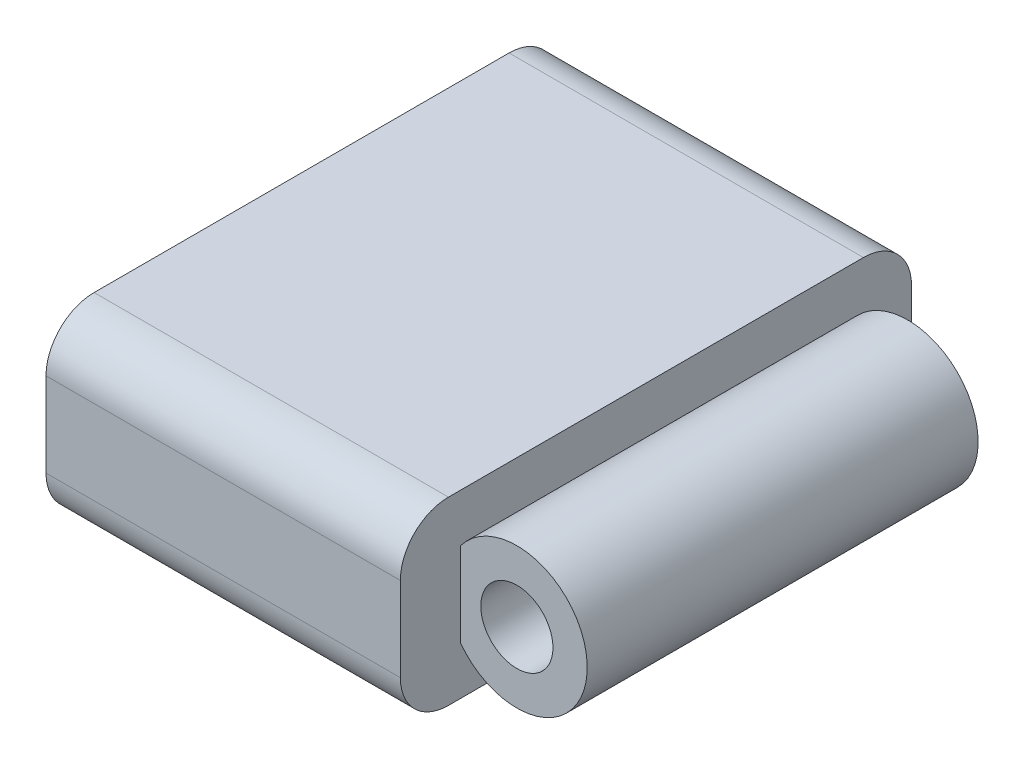
ISO-10303-21;
HEADER;
FILE_DESCRIPTION(('STEP AP214'),'2;1');
FILE_NAME('part.step','',(''),(''),'','','');
FILE_SCHEMA(('AUTOMOTIVE_DESIGN { 1 0 10303 214 1 1 1 1 }'));
ENDSEC;
DATA;
#1=APPLICATION_CONTEXT('core data for automotive mechanical design processes');
#2=APPLICATION_PROTOCOL_DEFINITION('international standard','automotive_design',2000,#1);
#3=PRODUCT_CONTEXT('',#1,'mechanical');
#4=PRODUCT('Part','Part','',(#3));
#5=PRODUCT_RELATED_PRODUCT_CATEGORY('part','',(#4));
#6=PRODUCT_DEFINITION_FORMATION('','',#4);
#7=PRODUCT_DEFINITION_CONTEXT('part definition',#1,'design');
#8=PRODUCT_DEFINITION('design','',#6,#7);
#9=PRODUCT_DEFINITION_SHAPE('','',#8);
#10=(LENGTH_UNIT() NAMED_UNIT(*) SI_UNIT(.MILLI.,.METRE.));
#11=(NAMED_UNIT(*) PLANE_ANGLE_UNIT() SI_UNIT($,.RADIAN.));
#12=(NAMED_UNIT(*) SI_UNIT($,.STERADIAN.) SOLID_ANGLE_UNIT());
#13=UNCERTAINTY_MEASURE_WITH_UNIT(LENGTH_MEASURE(1.E-05),#10,'distance_accuracy_value','');
#14=(GEOMETRIC_REPRESENTATION_CONTEXT(3) GLOBAL_UNCERTAINTY_ASSIGNED_CONTEXT((#13)) GLOBAL_UNIT_ASSIGNED_CONTEXT((#10,
#11,#12)) REPRESENTATION_CONTEXT('',''));
#15=CARTESIAN_POINT('',(0.,0.,0.));
#16=DIRECTION('',(0.,0.,1.));
#17=DIRECTION('',(1.,0.,0.));
#18=AXIS2_PLACEMENT_3D('',#15,#16,#17);
#19=CARTESIAN_POINT('',(0.,19.05,0.));
#20=DIRECTION('',(0.,0.,-1.));
#21=DIRECTION('',(-1.,0.,0.));
#22=AXIS2_PLACEMENT_3D('',#19,#20,#21);
#23=PLANE('',#22);
#24=DIRECTION('',(1.,0.,0.));
#25=VECTOR('',#24,1.);
#26=CARTESIAN_POINT('',(50.8,5.08,0.));
#27=LINE('',#26,#25);
#28=CARTESIAN_POINT('',(0.,5.08,0.));
#29=VERTEX_POINT('',#28);
#30=CARTESIAN_POINT('',(37.4173961667043,5.08,0.));
#31=VERTEX_POINT('',#30);
#32=EDGE_CURVE('E226',#29,#31,#27,.T.);
#33=ORIENTED_EDGE('',*,*,#32,.T.);
#34=DIRECTION('',(0.,1.,0.));
#35=VECTOR('',#34,1.);
#36=CARTESIAN_POINT('',(37.4173961667043,0.,0.));
#37=LINE('',#36,#35);
#38=CARTESIAN_POINT('',(37.4173961667043,13.97,0.));
#39=VERTEX_POINT('',#38);
#40=EDGE_CURVE('E318',#31,#39,#37,.T.);
#41=ORIENTED_EDGE('',*,*,#40,.T.);
#42=DIRECTION('',(1.,0.,0.));
#43=VECTOR('',#42,1.);
#44=CARTESIAN_POINT('',(0.,13.97,0.));
#45=LINE('',#44,#43);
#46=CARTESIAN_POINT('',(0.,13.97,0.));
#47=VERTEX_POINT('',#46);
#48=EDGE_CURVE('E224',#39,#47,#45,.F.);
#49=ORIENTED_EDGE('',*,*,#48,.T.);
#50=DIRECTION('',(0.,-1.,0.));
#51=VECTOR('',#50,1.);
#52=CARTESIAN_POINT('',(0.,19.05,0.));
#53=LINE('',#52,#51);
#54=EDGE_CURVE('E203',#47,#29,#53,.T.);
#55=ORIENTED_EDGE('',*,*,#54,.T.);
#56=EDGE_LOOP('',(#33,#41,#49,#55));
#57=FACE_BOUND('',#56,.T.);
#58=ADVANCED_FACE('F36',(#57),#23,.F.);
#59=CARTESIAN_POINT('',(0.,19.05,-53.975));
#60=DIRECTION('',(0.,0.,1.));
#61=DIRECTION('',(1.,0.,0.));
#62=AXIS2_PLACEMENT_3D('',#59,#60,#61);
#63=PLANE('',#62);
#64=DIRECTION('',(-1.,0.,0.));
#65=VECTOR('',#64,1.);
#66=CARTESIAN_POINT('',(0.,13.97,-53.975));
#67=LINE('',#66,#65);
#68=CARTESIAN_POINT('',(0.,13.97,-53.975));
#69=VERTEX_POINT('',#68);
#70=CARTESIAN_POINT('',(37.4173961667043,13.97,-53.975));
#71=VERTEX_POINT('',#70);
#72=EDGE_CURVE('E206',#69,#71,#67,.F.);
#73=ORIENTED_EDGE('',*,*,#72,.T.);
#74=DIRECTION('',(0.,1.,0.));
#75=VECTOR('',#74,1.);
#76=CARTESIAN_POINT('',(37.4173961667043,0.,-53.975));
#77=LINE('',#76,#75);
#78=CARTESIAN_POINT('',(37.4173961667043,5.08,-53.975));
#79=VERTEX_POINT('',#78);
#80=EDGE_CURVE('E176',#79,#71,#77,.T.);
#81=ORIENTED_EDGE('',*,*,#80,.F.);
#82=DIRECTION('',(-1.,0.,0.));
#83=VECTOR('',#82,1.);
#84=CARTESIAN_POINT('',(0.,5.08,-53.975));
#85=LINE('',#84,#83);
#86=CARTESIAN_POINT('',(0.,5.08,-53.975));
#87=VERTEX_POINT('',#86);
#88=EDGE_CURVE('E209',#79,#87,#85,.T.);
#89=ORIENTED_EDGE('',*,*,#88,.T.);
#90=DIRECTION('',(0.,-1.,0.));
#91=VECTOR('',#90,1.);
#92=CARTESIAN_POINT('',(0.,19.05,-53.975));
#93=LINE('',#92,#91);
#94=EDGE_CURVE('E198',#69,#87,#93,.T.);
#95=ORIENTED_EDGE('',*,*,#94,.F.);
#96=EDGE_LOOP('',(#73,#81,#89,#95));
#97=FACE_BOUND('',#96,.T.);
#98=ADVANCED_FACE('F332',(#97),#63,.F.);
#99=CARTESIAN_POINT('',(0.,19.05,0.));
#100=DIRECTION('',(1.,0.,0.));
#101=DIRECTION('',(0.,0.,-1.));
#102=AXIS2_PLACEMENT_3D('',#99,#100,#101);
#103=PLANE('',#102);
#104=DIRECTION('',(0.,0.,1.));
#105=VECTOR('',#104,1.);
#106=CARTESIAN_POINT('',(0.,1.90500000000001,-6.66749999999999));
#107=LINE('',#106,#105);
#108=CARTESIAN_POINT('',(0.,1.905,-44.7675));
#109=VERTEX_POINT('',#108);
#110=CARTESIAN_POINT('',(0.,1.90500000000001,-9.20749999999999));
#111=VERTEX_POINT('',#110);
#112=EDGE_CURVE('E274',#109,#111,#107,.T.);
#113=ORIENTED_EDGE('',*,*,#112,.F.);
#114=CARTESIAN_POINT('',(0.,4.44500000000001,-44.7675));
#115=DIRECTION('',(1.,0.,0.));
#116=DIRECTION('',(0.,0.,-1.));
#117=AXIS2_PLACEMENT_3D('',#114,#115,#116);
#118=CIRCLE('',#117,2.54);
#119=CARTESIAN_POINT('',(0.,4.44500000000001,-47.3075));
#120=VERTEX_POINT('',#119);
#121=EDGE_CURVE('E44',#109,#120,#118,.T.);
#122=ORIENTED_EDGE('',*,*,#121,.T.);
#123=DIRECTION('',(0.,-1.,0.));
#124=VECTOR('',#123,1.);
#125=CARTESIAN_POINT('',(0.,1.905,-47.3075));
#126=LINE('',#125,#124);
#127=CARTESIAN_POINT('',(0.,14.605,-47.3075));
#128=VERTEX_POINT('',#127);
#129=EDGE_CURVE('E285',#128,#120,#126,.T.);
#130=ORIENTED_EDGE('',*,*,#129,.F.);
#131=CARTESIAN_POINT('',(0.,14.605,-44.7675));
#132=DIRECTION('',(1.,0.,0.));
#133=DIRECTION('',(0.,0.,-1.));
#134=AXIS2_PLACEMENT_3D('',#131,#132,#133);
#135=CIRCLE('',#134,2.54);
#136=CARTESIAN_POINT('',(0.,17.145,-44.7675));
#137=VERTEX_POINT('',#136);
#138=EDGE_CURVE('E11',#128,#137,#135,.T.);
#139=ORIENTED_EDGE('',*,*,#138,.T.);
#140=DIRECTION('',(0.,0.,-1.));
#141=VECTOR('',#140,1.);
#142=CARTESIAN_POINT('',(0.,17.145,-6.66749999999999));
#143=LINE('',#142,#141);
#144=CARTESIAN_POINT('',(0.,17.145,-9.20749999999999));
#145=VERTEX_POINT('',#144);
#146=EDGE_CURVE('E310',#145,#137,#143,.T.);
#147=ORIENTED_EDGE('',*,*,#146,.F.);
#148=CARTESIAN_POINT('',(0.,14.605,-9.20749999999999));
#149=DIRECTION('',(1.,0.,0.));
#150=DIRECTION('',(0.,0.,-1.));
#151=AXIS2_PLACEMENT_3D('',#148,#149,#150);
#152=CIRCLE('',#151,2.54);
#153=CARTESIAN_POINT('',(0.,14.605,-6.66749999999999));
#154=VERTEX_POINT('',#153);
#155=EDGE_CURVE('E267',#145,#154,#152,.T.);
#156=ORIENTED_EDGE('',*,*,#155,.T.);
#157=DIRECTION('',(0.,1.,0.));
#158=VECTOR('',#157,1.);
#159=CARTESIAN_POINT('',(0.,1.90500000000001,-6.66749999999999));
#160=LINE('',#159,#158);
#161=CARTESIAN_POINT('',(0.,4.44500000000001,-6.66749999999999));
#162=VERTEX_POINT('',#161);
#163=EDGE_CURVE('E276',#162,#154,#160,.T.);
#164=ORIENTED_EDGE('',*,*,#163,.F.);
#165=CARTESIAN_POINT('',(0.,4.44500000000001,-9.20749999999999));
#166=DIRECTION('',(1.,0.,0.));
#167=DIRECTION('',(0.,0.,-1.));
#168=AXIS2_PLACEMENT_3D('',#165,#166,#167);
#169=CIRCLE('',#168,2.54);
#170=EDGE_CURVE('E269',#162,#111,#169,.T.);
#171=ORIENTED_EDGE('',*,*,#170,.T.);
#172=EDGE_LOOP('',(#113,#122,#130,#139,#147,#156,#164,#171));
#173=FACE_BOUND('',#172,.T.);
#174=ORIENTED_EDGE('',*,*,#94,.T.);
#175=CARTESIAN_POINT('',(0.,5.08,-48.895));
#176=DIRECTION('',(1.,0.,0.));
#177=DIRECTION('',(0.,0.,-1.));
#178=AXIS2_PLACEMENT_3D('',#175,#176,#177);
#179=CIRCLE('',#178,5.08);
#180=CARTESIAN_POINT('',(0.,0.,-48.895));
#181=VERTEX_POINT('',#180);
#182=EDGE_CURVE('E217',#87,#181,#179,.F.);
#183=ORIENTED_EDGE('',*,*,#182,.T.);
#184=DIRECTION('',(0.,0.,1.));
#185=VECTOR('',#184,1.);
#186=CARTESIAN_POINT('',(0.,0.,0.));
#187=LINE('',#186,#185);
#188=CARTESIAN_POINT('',(0.,0.,-5.08));
#189=VERTEX_POINT('',#188);
#190=EDGE_CURVE('E194',#181,#189,#187,.T.);
#191=ORIENTED_EDGE('',*,*,#190,.T.);
#192=CARTESIAN_POINT('',(0.,5.08,-5.08));
#193=DIRECTION('',(1.,0.,0.));
#194=DIRECTION('',(0.,0.,-1.));
#195=AXIS2_PLACEMENT_3D('',#192,#193,#194);
#196=CIRCLE('',#195,5.08);
#197=EDGE_CURVE('E215',#189,#29,#196,.F.);
#198=ORIENTED_EDGE('',*,*,#197,.T.);
#199=ORIENTED_EDGE('',*,*,#54,.F.);
#200=CARTESIAN_POINT('',(0.,13.97,-5.08));
#201=DIRECTION('',(1.,0.,0.));
#202=DIRECTION('',(0.,0.,-1.));
#203=AXIS2_PLACEMENT_3D('',#200,#201,#202);
#204=CIRCLE('',#203,5.08);
#205=CARTESIAN_POINT('',(0.,19.05,-5.08));
#206=VERTEX_POINT('',#205);
#207=EDGE_CURVE('E211',#47,#206,#204,.F.);
#208=ORIENTED_EDGE('',*,*,#207,.T.);
#209=DIRECTION('',(0.,0.,1.));
#210=VECTOR('',#209,1.);
#211=CARTESIAN_POINT('',(0.,19.05,0.));
#212=LINE('',#211,#210);
#213=CARTESIAN_POINT('',(0.,19.05,-48.895));
#214=VERTEX_POINT('',#213);
#215=EDGE_CURVE('E195',#214,#206,#212,.T.);
#216=ORIENTED_EDGE('',*,*,#215,.F.);
#217=CARTESIAN_POINT('',(0.,13.97,-48.895));
#218=DIRECTION('',(1.,0.,0.));
#219=DIRECTION('',(0.,0.,-1.));
#220=AXIS2_PLACEMENT_3D('',#217,#218,#219);
#221=CIRCLE('',#220,5.08);
#222=EDGE_CURVE('E213',#214,#69,#221,.F.);
#223=ORIENTED_EDGE('',*,*,#222,.T.);
#224=EDGE_LOOP('',(#174,#183,#191,#198,#199,#208,#216,#223));
#225=FACE_BOUND('',#224,.T.);
#226=ADVANCED_FACE('F272',(#173,#225),#103,.F.);
#227=CARTESIAN_POINT('',(0.,19.05,0.));
#228=DIRECTION('',(0.,-1.,0.));
#229=DIRECTION('',(0.,0.,-1.));
#230=AXIS2_PLACEMENT_3D('',#227,#228,#229);
#231=PLANE('',#230);
#232=DIRECTION('',(1.,0.,0.));
#233=VECTOR('',#232,1.);
#234=CARTESIAN_POINT('',(0.,19.05,-5.08));
#235=LINE('',#234,#233);
#236=CARTESIAN_POINT('',(37.4173961667043,19.05,-5.08));
#237=VERTEX_POINT('',#236);
#238=EDGE_CURVE('E229',#206,#237,#235,.T.);
#239=ORIENTED_EDGE('',*,*,#238,.T.);
#240=DIRECTION('',(0.,0.,1.));
#241=VECTOR('',#240,1.);
#242=CARTESIAN_POINT('',(37.4173961667043,19.05,-53.975));
#243=LINE('',#242,#241);
#244=CARTESIAN_POINT('',(37.4173961667043,19.05,-48.895));
#245=VERTEX_POINT('',#244);
#246=EDGE_CURVE('E189',#245,#237,#243,.T.);
#247=ORIENTED_EDGE('',*,*,#246,.F.);
#248=DIRECTION('',(-1.,0.,0.));
#249=VECTOR('',#248,1.);
#250=CARTESIAN_POINT('',(0.,19.05,-48.895));
#251=LINE('',#250,#249);
#252=EDGE_CURVE('E232',#245,#214,#251,.T.);
#253=ORIENTED_EDGE('',*,*,#252,.T.);
#254=ORIENTED_EDGE('',*,*,#215,.T.);
#255=EDGE_LOOP('',(#239,#247,#253,#254));
#256=FACE_BOUND('',#255,.T.);
#257=ADVANCED_FACE('F340',(#256),#231,.F.);
#258=CARTESIAN_POINT('',(0.,0.,0.));
#259=DIRECTION('',(0.,-1.,0.));
#260=DIRECTION('',(0.,0.,-1.));
#261=AXIS2_PLACEMENT_3D('',#258,#259,#260);
#262=PLANE('',#261);
#263=DIRECTION('',(0.,0.,1.));
#264=VECTOR('',#263,1.);
#265=CARTESIAN_POINT('',(37.4173961667043,0.,-53.975));
#266=LINE('',#265,#264);
#267=CARTESIAN_POINT('',(37.4173961667043,0.,-48.895));
#268=VERTEX_POINT('',#267);
#269=CARTESIAN_POINT('',(37.4173961667043,0.,-5.08));
#270=VERTEX_POINT('',#269);
#271=EDGE_CURVE('E181',#268,#270,#266,.T.);
#272=ORIENTED_EDGE('',*,*,#271,.T.);
#273=DIRECTION('',(1.,0.,0.));
#274=VECTOR('',#273,1.);
#275=CARTESIAN_POINT('',(0.,0.,-5.08));
#276=LINE('',#275,#274);
#277=EDGE_CURVE('E219',#270,#189,#276,.F.);
#278=ORIENTED_EDGE('',*,*,#277,.T.);
#279=ORIENTED_EDGE('',*,*,#190,.F.);
#280=DIRECTION('',(-1.,0.,0.));
#281=VECTOR('',#280,1.);
#282=CARTESIAN_POINT('',(50.8,0.,-48.895));
#283=LINE('',#282,#281);
#284=EDGE_CURVE('E221',#181,#268,#283,.F.);
#285=ORIENTED_EDGE('',*,*,#284,.T.);
#286=EDGE_LOOP('',(#272,#278,#279,#285));
#287=FACE_BOUND('',#286,.T.);
#288=ADVANCED_FACE('F354',(#287),#262,.T.);
#289=CARTESIAN_POINT('',(0.,5.08,-48.895));
#290=DIRECTION('',(1.,0.,0.));
#291=DIRECTION('',(0.,0.,-1.));
#292=AXIS2_PLACEMENT_3D('',#289,#290,#291);
#293=CYLINDRICAL_SURFACE('',#292,5.08);
#294=CARTESIAN_POINT('',(37.4173961667043,5.08,-48.895));
#295=DIRECTION('',(-1.,0.,0.));
#296=DIRECTION('',(0.,0.,1.));
#297=AXIS2_PLACEMENT_3D('',#294,#295,#296);
#298=CIRCLE('',#297,5.08);
#299=EDGE_CURVE('E183',#268,#79,#298,.F.);
#300=ORIENTED_EDGE('',*,*,#299,.F.);
#301=ORIENTED_EDGE('',*,*,#284,.F.);
#302=ORIENTED_EDGE('',*,*,#182,.F.);
#303=ORIENTED_EDGE('',*,*,#88,.F.);
#304=EDGE_LOOP('',(#300,#301,#302,#303));
#305=FACE_BOUND('',#304,.T.);
#306=ADVANCED_FACE('F356',(#305),#293,.T.);
#307=CARTESIAN_POINT('',(0.,5.08,-5.08));
#308=DIRECTION('',(-1.,0.,0.));
#309=DIRECTION('',(0.,0.,1.));
#310=AXIS2_PLACEMENT_3D('',#307,#308,#309);
#311=CYLINDRICAL_SURFACE('',#310,5.08);
#312=CARTESIAN_POINT('',(37.4173961667043,5.08,-5.08));
#313=DIRECTION('',(-1.,0.,0.));
#314=DIRECTION('',(0.,0.,1.));
#315=AXIS2_PLACEMENT_3D('',#312,#313,#314);
#316=CIRCLE('',#315,5.08);
#317=EDGE_CURVE('E237',#31,#270,#316,.F.);
#318=ORIENTED_EDGE('',*,*,#317,.F.);
#319=ORIENTED_EDGE('',*,*,#32,.F.);
#320=ORIENTED_EDGE('',*,*,#197,.F.);
#321=ORIENTED_EDGE('',*,*,#277,.F.);
#322=EDGE_LOOP('',(#318,#319,#320,#321));
#323=FACE_BOUND('',#322,.T.);
#324=ADVANCED_FACE('F350',(#323),#311,.T.);
#325=CARTESIAN_POINT('',(0.,13.97,-48.895));
#326=DIRECTION('',(-1.,0.,0.));
#327=DIRECTION('',(0.,0.,1.));
#328=AXIS2_PLACEMENT_3D('',#325,#326,#327);
#329=CYLINDRICAL_SURFACE('',#328,5.08);
#330=CARTESIAN_POINT('',(37.4173961667043,13.97,-48.895));
#331=DIRECTION('',(-1.,0.,0.));
#332=DIRECTION('',(0.,0.,1.));
#333=AXIS2_PLACEMENT_3D('',#330,#331,#332);
#334=CIRCLE('',#333,5.08);
#335=EDGE_CURVE('E191',#71,#245,#334,.F.);
#336=ORIENTED_EDGE('',*,*,#335,.F.);
#337=ORIENTED_EDGE('',*,*,#72,.F.);
#338=ORIENTED_EDGE('',*,*,#222,.F.);
#339=ORIENTED_EDGE('',*,*,#252,.F.);
#340=EDGE_LOOP('',(#336,#337,#338,#339));
#341=FACE_BOUND('',#340,.T.);
#342=ADVANCED_FACE('F329',(#341),#329,.T.);
#343=CARTESIAN_POINT('',(0.,13.97,-5.08));
#344=DIRECTION('',(1.,0.,0.));
#345=DIRECTION('',(0.,0.,-1.));
#346=AXIS2_PLACEMENT_3D('',#343,#344,#345);
#347=CYLINDRICAL_SURFACE('',#346,5.08);
#348=CARTESIAN_POINT('',(37.4173961667043,13.97,-5.08));
#349=DIRECTION('',(-1.,0.,0.));
#350=DIRECTION('',(0.,0.,1.));
#351=AXIS2_PLACEMENT_3D('',#348,#349,#350);
#352=CIRCLE('',#351,5.08);
#353=EDGE_CURVE('E234',#237,#39,#352,.F.);
#354=ORIENTED_EDGE('',*,*,#353,.F.);
#355=ORIENTED_EDGE('',*,*,#238,.F.);
#356=ORIENTED_EDGE('',*,*,#207,.F.);
#357=ORIENTED_EDGE('',*,*,#48,.F.);
#358=EDGE_LOOP('',(#354,#355,#356,#357));
#359=FACE_BOUND('',#358,.T.);
#360=ADVANCED_FACE('F343',(#359),#347,.T.);
#361=CARTESIAN_POINT('',(43.3705,9.525,-53.975));
#362=DIRECTION('',(0.,0.,1.));
#363=DIRECTION('',(1.,0.,0.));
#364=AXIS2_PLACEMENT_3D('',#361,#362,#363);
#365=CYLINDRICAL_SURFACE('',#364,7.4295);
#366=CARTESIAN_POINT('',(43.3705,9.525,-6.35));
#367=DIRECTION('',(0.,0.,-1.));
#368=DIRECTION('',(-1.,0.,0.));
#369=AXIS2_PLACEMENT_3D('',#366,#367,#368);
#370=CIRCLE('',#369,7.4295);
#371=CARTESIAN_POINT('',(37.4173961667043,5.08,-6.35));
#372=VERTEX_POINT('',#371);
#373=CARTESIAN_POINT('',(37.4173961667043,13.97,-6.35));
#374=VERTEX_POINT('',#373);
#375=EDGE_CURVE('E167',#372,#374,#370,.F.);
#376=ORIENTED_EDGE('',*,*,#375,.F.);
#377=DIRECTION('',(0.,0.,1.));
#378=VECTOR('',#377,1.);
#379=CARTESIAN_POINT('',(37.4173961667043,5.08,-53.975));
#380=LINE('',#379,#378);
#381=CARTESIAN_POINT('',(37.4173961667043,5.08,-47.625));
#382=VERTEX_POINT('',#381);
#383=EDGE_CURVE('E174',#382,#372,#380,.T.);
#384=ORIENTED_EDGE('',*,*,#383,.F.);
#385=CARTESIAN_POINT('',(43.3705,9.525,-47.625));
#386=DIRECTION('',(0.,0.,1.));
#387=DIRECTION('',(1.,0.,0.));
#388=AXIS2_PLACEMENT_3D('',#385,#386,#387);
#389=CIRCLE('',#388,7.4295);
#390=CARTESIAN_POINT('',(37.4173961667043,13.97,-47.625));
#391=VERTEX_POINT('',#390);
#392=EDGE_CURVE('E159',#391,#382,#389,.F.);
#393=ORIENTED_EDGE('',*,*,#392,.F.);
#394=DIRECTION('',(0.,0.,1.));
#395=VECTOR('',#394,1.);
#396=CARTESIAN_POINT('',(37.4173961667043,13.97,-53.975));
#397=LINE('',#396,#395);
#398=EDGE_CURVE('E175',#391,#374,#397,.T.);
#399=ORIENTED_EDGE('',*,*,#398,.T.);
#400=EDGE_LOOP('',(#376,#384,#393,#399));
#401=FACE_BOUND('',#400,.T.);
#402=ADVANCED_FACE('F180',(#401),#365,.T.);
#403=CARTESIAN_POINT('',(37.4173961667043,0.,-53.975));
#404=DIRECTION('',(-1.,0.,0.));
#405=DIRECTION('',(0.,0.,1.));
#406=AXIS2_PLACEMENT_3D('',#403,#404,#405);
#407=PLANE('',#406);
#408=ORIENTED_EDGE('',*,*,#40,.F.);
#409=ORIENTED_EDGE('',*,*,#317,.T.);
#410=ORIENTED_EDGE('',*,*,#271,.F.);
#411=ORIENTED_EDGE('',*,*,#299,.T.);
#412=ORIENTED_EDGE('',*,*,#80,.T.);
#413=ORIENTED_EDGE('',*,*,#335,.T.);
#414=ORIENTED_EDGE('',*,*,#246,.T.);
#415=ORIENTED_EDGE('',*,*,#353,.T.);
#416=EDGE_LOOP('',(#408,#409,#410,#411,#412,#413,#414,#415));
#417=FACE_BOUND('',#416,.T.);
#418=ORIENTED_EDGE('',*,*,#383,.T.);
#419=DIRECTION('',(0.,1.,0.));
#420=VECTOR('',#419,1.);
#421=CARTESIAN_POINT('',(37.4173961667043,0.,-6.35));
#422=LINE('',#421,#420);
#423=EDGE_CURVE('E168',#372,#374,#422,.T.);
#424=ORIENTED_EDGE('',*,*,#423,.T.);
#425=ORIENTED_EDGE('',*,*,#398,.F.);
#426=DIRECTION('',(0.,1.,0.));
#427=VECTOR('',#426,1.);
#428=CARTESIAN_POINT('',(37.4173961667043,0.,-47.625));
#429=LINE('',#428,#427);
#430=EDGE_CURVE('E162',#382,#391,#429,.T.);
#431=ORIENTED_EDGE('',*,*,#430,.F.);
#432=EDGE_LOOP('',(#418,#424,#425,#431));
#433=FACE_BOUND('',#432,.T.);
#434=ADVANCED_FACE('F172',(#417,#433),#407,.F.);
#435=CARTESIAN_POINT('',(37.4173961667043,0.,-47.625));
#436=DIRECTION('',(0.,0.,1.));
#437=DIRECTION('',(1.,0.,0.));
#438=AXIS2_PLACEMENT_3D('',#435,#436,#437);
#439=PLANE('',#438);
#440=CARTESIAN_POINT('',(43.3705,9.525,-47.625));
#441=DIRECTION('',(0.,0.,1.));
#442=DIRECTION('',(1.,0.,0.));
#443=AXIS2_PLACEMENT_3D('',#440,#441,#442);
#444=CIRCLE('',#443,3.81);
#445=CARTESIAN_POINT('',(47.1805,9.525,-47.625));
#446=VERTEX_POINT('',#445);
#447=EDGE_CURVE('E177',#446,#446,#444,.T.);
#448=ORIENTED_EDGE('',*,*,#447,.T.);
#449=EDGE_LOOP('',(#448));
#450=FACE_BOUND('',#449,.T.);
#451=ORIENTED_EDGE('',*,*,#392,.T.);
#452=ORIENTED_EDGE('',*,*,#430,.T.);
#453=EDGE_LOOP('',(#451,#452));
#454=FACE_BOUND('',#453,.T.);
#455=ADVANCED_FACE('F161',(#450,#454),#439,.F.);
#456=CARTESIAN_POINT('',(37.4173961667043,0.,-6.35));
#457=DIRECTION('',(0.,0.,-1.));
#458=DIRECTION('',(-1.,0.,0.));
#459=AXIS2_PLACEMENT_3D('',#456,#457,#458);
#460=PLANE('',#459);
#461=CARTESIAN_POINT('',(43.3705,9.525,-6.35));
#462=DIRECTION('',(0.,0.,1.));
#463=DIRECTION('',(1.,0.,0.));
#464=AXIS2_PLACEMENT_3D('',#461,#462,#463);
#465=CIRCLE('',#464,3.81);
#466=CARTESIAN_POINT('',(47.1805,9.525,-6.35));
#467=VERTEX_POINT('',#466);
#468=EDGE_CURVE('E302',#467,#467,#465,.T.);
#469=ORIENTED_EDGE('',*,*,#468,.F.);
#470=EDGE_LOOP('',(#469));
#471=FACE_BOUND('',#470,.T.);
#472=ORIENTED_EDGE('',*,*,#375,.T.);
#473=ORIENTED_EDGE('',*,*,#423,.F.);
#474=EDGE_LOOP('',(#472,#473));
#475=FACE_BOUND('',#474,.T.);
#476=ADVANCED_FACE('F386',(#471,#475),#460,.F.);
#477=CARTESIAN_POINT('',(43.3705,9.525,-53.975));
#478=DIRECTION('',(0.,0.,1.));
#479=DIRECTION('',(1.,0.,0.));
#480=AXIS2_PLACEMENT_3D('',#477,#478,#479);
#481=CYLINDRICAL_SURFACE('',#480,3.81);
#482=ORIENTED_EDGE('',*,*,#468,.T.);
#483=EDGE_LOOP('',(#482));
#484=FACE_BOUND('',#483,.T.);
#485=ORIENTED_EDGE('',*,*,#447,.F.);
#486=EDGE_LOOP('',(#485));
#487=FACE_BOUND('',#486,.T.);
#488=ADVANCED_FACE('F390',(#484,#487),#481,.F.);
#489=CARTESIAN_POINT('',(17.78,1.905,-47.3075));
#490=DIRECTION('',(0.,0.,-1.));
#491=DIRECTION('',(-1.,0.,0.));
#492=AXIS2_PLACEMENT_3D('',#489,#490,#491);
#493=PLANE('',#492);
#494=ORIENTED_EDGE('',*,*,#129,.T.);
#495=DIRECTION('',(-1.,0.,0.));
#496=VECTOR('',#495,1.);
#497=CARTESIAN_POINT('',(17.78,4.44500000000001,-47.3075));
#498=LINE('',#497,#496);
#499=CARTESIAN_POINT('',(17.78,4.44500000000001,-47.3075));
#500=VERTEX_POINT('',#499);
#501=EDGE_CURVE('E265',#120,#500,#498,.F.);
#502=ORIENTED_EDGE('',*,*,#501,.T.);
#503=DIRECTION('',(0.,-1.,0.));
#504=VECTOR('',#503,1.);
#505=CARTESIAN_POINT('',(17.78,1.905,-47.3075));
#506=LINE('',#505,#504);
#507=CARTESIAN_POINT('',(17.78,14.605,-47.3075));
#508=VERTEX_POINT('',#507);
#509=EDGE_CURVE('E304',#508,#500,#506,.T.);
#510=ORIENTED_EDGE('',*,*,#509,.F.);
#511=DIRECTION('',(-1.,0.,0.));
#512=VECTOR('',#511,1.);
#513=CARTESIAN_POINT('',(0.,14.605,-47.3075));
#514=LINE('',#513,#512);
#515=EDGE_CURVE('E263',#508,#128,#514,.T.);
#516=ORIENTED_EDGE('',*,*,#515,.T.);
#517=EDGE_LOOP('',(#494,#502,#510,#516));
#518=FACE_BOUND('',#517,.T.);
#519=ADVANCED_FACE('F394',(#518),#493,.F.);
#520=CARTESIAN_POINT('',(17.78,17.145,-6.66749999999999));
#521=DIRECTION('',(0.,1.,0.));
#522=DIRECTION('',(0.,0.,1.));
#523=AXIS2_PLACEMENT_3D('',#520,#521,#522);
#524=PLANE('',#523);
#525=DIRECTION('',(0.,0.,-1.));
#526=VECTOR('',#525,1.);
#527=CARTESIAN_POINT('',(17.78,17.145,-6.66749999999999));
#528=LINE('',#527,#526);
#529=CARTESIAN_POINT('',(17.78,17.145,-9.20749999999999));
#530=VERTEX_POINT('',#529);
#531=CARTESIAN_POINT('',(17.78,17.145,-44.7675));
#532=VERTEX_POINT('',#531);
#533=EDGE_CURVE('E299',#530,#532,#528,.T.);
#534=ORIENTED_EDGE('',*,*,#533,.F.);
#535=DIRECTION('',(-1.,0.,0.));
#536=VECTOR('',#535,1.);
#537=CARTESIAN_POINT('',(0.,17.145,-9.20749999999999));
#538=LINE('',#537,#536);
#539=EDGE_CURVE('E242',#530,#145,#538,.T.);
#540=ORIENTED_EDGE('',*,*,#539,.T.);
#541=ORIENTED_EDGE('',*,*,#146,.T.);
#542=DIRECTION('',(-1.,0.,0.));
#543=VECTOR('',#542,1.);
#544=CARTESIAN_POINT('',(17.78,17.145,-44.7675));
#545=LINE('',#544,#543);
#546=EDGE_CURVE('E240',#137,#532,#545,.F.);
#547=ORIENTED_EDGE('',*,*,#546,.T.);
#548=EDGE_LOOP('',(#534,#540,#541,#547));
#549=FACE_BOUND('',#548,.T.);
#550=ADVANCED_FACE('F398',(#549),#524,.F.);
#551=CARTESIAN_POINT('',(17.78,1.90500000000001,-6.66749999999999));
#552=DIRECTION('',(0.,0.,1.));
#553=DIRECTION('',(1.,0.,0.));
#554=AXIS2_PLACEMENT_3D('',#551,#552,#553);
#555=PLANE('',#554);
#556=ORIENTED_EDGE('',*,*,#163,.T.);
#557=DIRECTION('',(-1.,0.,0.));
#558=VECTOR('',#557,1.);
#559=CARTESIAN_POINT('',(17.78,14.605,-6.66749999999999));
#560=LINE('',#559,#558);
#561=CARTESIAN_POINT('',(17.78,14.605,-6.66749999999999));
#562=VERTEX_POINT('',#561);
#563=EDGE_CURVE('E248',#154,#562,#560,.F.);
#564=ORIENTED_EDGE('',*,*,#563,.T.);
#565=DIRECTION('',(0.,1.,0.));
#566=VECTOR('',#565,1.);
#567=CARTESIAN_POINT('',(17.78,1.90500000000001,-6.66749999999999));
#568=LINE('',#567,#566);
#569=CARTESIAN_POINT('',(17.78,4.44500000000001,-6.66749999999999));
#570=VERTEX_POINT('',#569);
#571=EDGE_CURVE('E293',#570,#562,#568,.T.);
#572=ORIENTED_EDGE('',*,*,#571,.F.);
#573=DIRECTION('',(-1.,0.,0.));
#574=VECTOR('',#573,1.);
#575=CARTESIAN_POINT('',(0.,4.44500000000001,-6.66749999999999));
#576=LINE('',#575,#574);
#577=EDGE_CURVE('E245',#570,#162,#576,.T.);
#578=ORIENTED_EDGE('',*,*,#577,.T.);
#579=EDGE_LOOP('',(#556,#564,#572,#578));
#580=FACE_BOUND('',#579,.T.);
#581=ADVANCED_FACE('F297',(#580),#555,.F.);
#582=CARTESIAN_POINT('',(17.78,1.90500000000001,-6.66749999999999));
#583=DIRECTION('',(0.,-1.,0.));
#584=DIRECTION('',(0.,0.,-1.));
#585=AXIS2_PLACEMENT_3D('',#582,#583,#584);
#586=PLANE('',#585);
#587=ORIENTED_EDGE('',*,*,#112,.T.);
#588=DIRECTION('',(-1.,0.,0.));
#589=VECTOR('',#588,1.);
#590=CARTESIAN_POINT('',(17.78,1.90500000000001,-9.20749999999999));
#591=LINE('',#590,#589);
#592=CARTESIAN_POINT('',(17.78,1.90500000000001,-9.20749999999999));
#593=VERTEX_POINT('',#592);
#594=EDGE_CURVE('E261',#111,#593,#591,.F.);
#595=ORIENTED_EDGE('',*,*,#594,.T.);
#596=DIRECTION('',(0.,0.,1.));
#597=VECTOR('',#596,1.);
#598=CARTESIAN_POINT('',(17.78,1.90500000000001,-6.66749999999999));
#599=LINE('',#598,#597);
#600=CARTESIAN_POINT('',(17.78,1.905,-44.7675));
#601=VERTEX_POINT('',#600);
#602=EDGE_CURVE('E295',#601,#593,#599,.T.);
#603=ORIENTED_EDGE('',*,*,#602,.F.);
#604=DIRECTION('',(-1.,0.,0.));
#605=VECTOR('',#604,1.);
#606=CARTESIAN_POINT('',(0.,1.90500000000001,-44.7675));
#607=LINE('',#606,#605);
#608=EDGE_CURVE('E258',#601,#109,#607,.T.);
#609=ORIENTED_EDGE('',*,*,#608,.T.);
#610=EDGE_LOOP('',(#587,#595,#603,#609));
#611=FACE_BOUND('',#610,.T.);
#612=ADVANCED_FACE('F281',(#611),#586,.F.);
#613=CARTESIAN_POINT('',(17.78,0.,0.));
#614=DIRECTION('',(-1.,0.,0.));
#615=DIRECTION('',(0.,0.,1.));
#616=AXIS2_PLACEMENT_3D('',#613,#614,#615);
#617=PLANE('',#616);
#618=ORIENTED_EDGE('',*,*,#571,.T.);
#619=CARTESIAN_POINT('',(17.78,14.605,-9.20749999999999));
#620=DIRECTION('',(-1.,0.,0.));
#621=DIRECTION('',(0.,0.,1.));
#622=AXIS2_PLACEMENT_3D('',#619,#620,#621);
#623=CIRCLE('',#622,2.54);
#624=EDGE_CURVE('E256',#562,#530,#623,.T.);
#625=ORIENTED_EDGE('',*,*,#624,.T.);
#626=ORIENTED_EDGE('',*,*,#533,.T.);
#627=CARTESIAN_POINT('',(17.78,14.605,-44.7675));
#628=DIRECTION('',(-1.,0.,0.));
#629=DIRECTION('',(0.,0.,1.));
#630=AXIS2_PLACEMENT_3D('',#627,#628,#629);
#631=CIRCLE('',#630,2.54);
#632=EDGE_CURVE('E250',#532,#508,#631,.T.);
#633=ORIENTED_EDGE('',*,*,#632,.T.);
#634=ORIENTED_EDGE('',*,*,#509,.T.);
#635=CARTESIAN_POINT('',(17.78,4.44500000000001,-44.7675));
#636=DIRECTION('',(-1.,0.,0.));
#637=DIRECTION('',(0.,0.,1.));
#638=AXIS2_PLACEMENT_3D('',#635,#636,#637);
#639=CIRCLE('',#638,2.54);
#640=EDGE_CURVE('E252',#500,#601,#639,.T.);
#641=ORIENTED_EDGE('',*,*,#640,.T.);
#642=ORIENTED_EDGE('',*,*,#602,.T.);
#643=CARTESIAN_POINT('',(17.78,4.44500000000001,-9.20749999999999));
#644=DIRECTION('',(-1.,0.,0.));
#645=DIRECTION('',(0.,0.,1.));
#646=AXIS2_PLACEMENT_3D('',#643,#644,#645);
#647=CIRCLE('',#646,2.54);
#648=EDGE_CURVE('E254',#593,#570,#647,.T.);
#649=ORIENTED_EDGE('',*,*,#648,.T.);
#650=EDGE_LOOP('',(#618,#625,#626,#633,#634,#641,#642,#649));
#651=FACE_BOUND('',#650,.T.);
#652=ADVANCED_FACE('F292',(#651),#617,.T.);
#653=CARTESIAN_POINT('',(17.78,14.605,-9.20749999999999));
#654=DIRECTION('',(1.,0.,0.));
#655=DIRECTION('',(0.,0.,-1.));
#656=AXIS2_PLACEMENT_3D('',#653,#654,#655);
#657=CYLINDRICAL_SURFACE('',#656,2.54);
#658=ORIENTED_EDGE('',*,*,#624,.F.);
#659=ORIENTED_EDGE('',*,*,#563,.F.);
#660=ORIENTED_EDGE('',*,*,#155,.F.);
#661=ORIENTED_EDGE('',*,*,#539,.F.);
#662=EDGE_LOOP('',(#658,#659,#660,#661));
#663=FACE_BOUND('',#662,.T.);
#664=ADVANCED_FACE('F408',(#663),#657,.F.);
#665=CARTESIAN_POINT('',(17.78,4.44500000000001,-9.20749999999999));
#666=DIRECTION('',(1.,0.,0.));
#667=DIRECTION('',(0.,0.,-1.));
#668=AXIS2_PLACEMENT_3D('',#665,#666,#667);
#669=CYLINDRICAL_SURFACE('',#668,2.54);
#670=ORIENTED_EDGE('',*,*,#648,.F.);
#671=ORIENTED_EDGE('',*,*,#594,.F.);
#672=ORIENTED_EDGE('',*,*,#170,.F.);
#673=ORIENTED_EDGE('',*,*,#577,.F.);
#674=EDGE_LOOP('',(#670,#671,#672,#673));
#675=FACE_BOUND('',#674,.T.);
#676=ADVANCED_FACE('F288',(#675),#669,.F.);
#677=CARTESIAN_POINT('',(17.78,4.44500000000001,-44.7675));
#678=DIRECTION('',(1.,0.,0.));
#679=DIRECTION('',(0.,0.,-1.));
#680=AXIS2_PLACEMENT_3D('',#677,#678,#679);
#681=CYLINDRICAL_SURFACE('',#680,2.54);
#682=ORIENTED_EDGE('',*,*,#640,.F.);
#683=ORIENTED_EDGE('',*,*,#501,.F.);
#684=ORIENTED_EDGE('',*,*,#121,.F.);
#685=ORIENTED_EDGE('',*,*,#608,.F.);
#686=EDGE_LOOP('',(#682,#683,#684,#685));
#687=FACE_BOUND('',#686,.T.);
#688=ADVANCED_FACE('F417',(#687),#681,.F.);
#689=CARTESIAN_POINT('',(17.78,14.605,-44.7675));
#690=DIRECTION('',(1.,0.,0.));
#691=DIRECTION('',(0.,0.,-1.));
#692=AXIS2_PLACEMENT_3D('',#689,#690,#691);
#693=CYLINDRICAL_SURFACE('',#692,2.54);
#694=ORIENTED_EDGE('',*,*,#632,.F.);
#695=ORIENTED_EDGE('',*,*,#546,.F.);
#696=ORIENTED_EDGE('',*,*,#138,.F.);
#697=ORIENTED_EDGE('',*,*,#515,.F.);
#698=EDGE_LOOP('',(#694,#695,#696,#697));
#699=FACE_BOUND('',#698,.T.);
#700=ADVANCED_FACE('F38',(#699),#693,.F.);
#701=CLOSED_SHELL('',(#58,#98,#226,#257,#288,#306,#324,#342,#360,#402,#434,#455,#476,#488,#519,
#550,#581,#612,#652,#664,#676,#688,#700));
#702=MANIFOLD_SOLID_BREP('B2',#701);
#703=ADVANCED_BREP_SHAPE_REPRESENTATION('',(#18,#702),#14);
#704=SHAPE_DEFINITION_REPRESENTATION(#9,#703);
ENDSEC;
END-ISO-10303-21;
